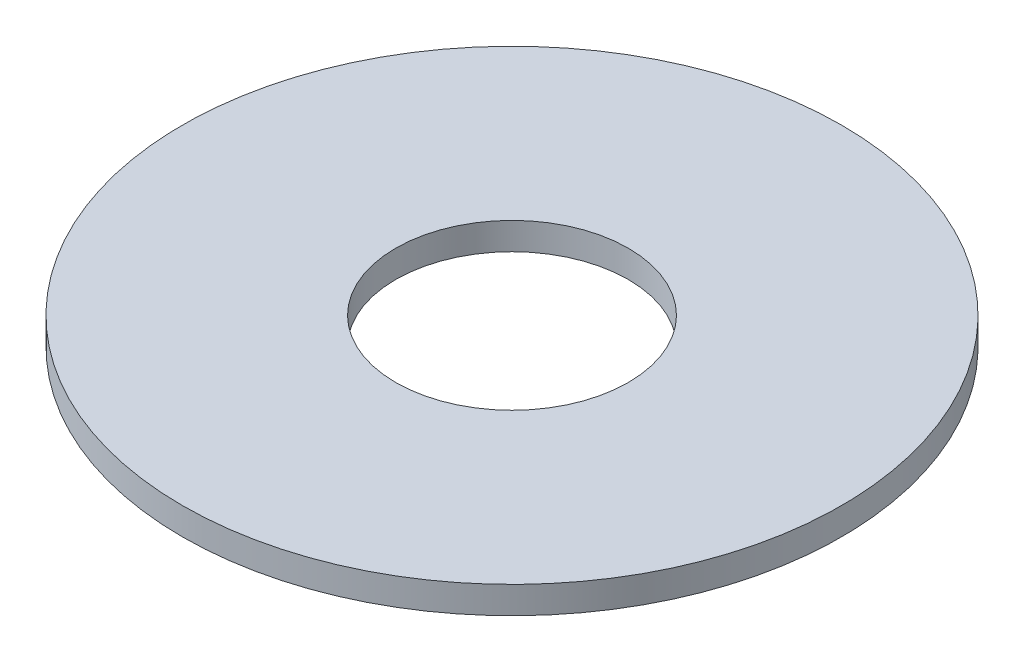
ISO-10303-21;
HEADER;
FILE_DESCRIPTION(('STEP AP214'),'2;1');
FILE_NAME('part.step','',(''),(''),'','','');
FILE_SCHEMA(('AUTOMOTIVE_DESIGN { 1 0 10303 214 1 1 1 1 }'));
ENDSEC;
DATA;
#1=APPLICATION_CONTEXT('core data for automotive mechanical design processes');
#2=APPLICATION_PROTOCOL_DEFINITION('international standard','automotive_design',2000,#1);
#3=PRODUCT_CONTEXT('',#1,'mechanical');
#4=PRODUCT('Part','Part','',(#3));
#5=PRODUCT_RELATED_PRODUCT_CATEGORY('part','',(#4));
#6=PRODUCT_DEFINITION_FORMATION('','',#4);
#7=PRODUCT_DEFINITION_CONTEXT('part definition',#1,'design');
#8=PRODUCT_DEFINITION('design','',#6,#7);
#9=PRODUCT_DEFINITION_SHAPE('','',#8);
#10=(LENGTH_UNIT() NAMED_UNIT(*) SI_UNIT(.MILLI.,.METRE.));
#11=(NAMED_UNIT(*) PLANE_ANGLE_UNIT() SI_UNIT($,.RADIAN.));
#12=(NAMED_UNIT(*) SI_UNIT($,.STERADIAN.) SOLID_ANGLE_UNIT());
#13=UNCERTAINTY_MEASURE_WITH_UNIT(LENGTH_MEASURE(1.E-05),#10,'distance_accuracy_value','');
#14=(GEOMETRIC_REPRESENTATION_CONTEXT(3) GLOBAL_UNCERTAINTY_ASSIGNED_CONTEXT((#13)) GLOBAL_UNIT_ASSIGNED_CONTEXT((#10,
#11,#12)) REPRESENTATION_CONTEXT('',''));
#15=CARTESIAN_POINT('',(0.,0.,0.));
#16=DIRECTION('',(0.,0.,1.));
#17=DIRECTION('',(1.,0.,0.));
#18=AXIS2_PLACEMENT_3D('',#15,#16,#17);
#19=CARTESIAN_POINT('',(0.,7.,0.));
#20=DIRECTION('',(0.,-1.,0.));
#21=DIRECTION('',(0.,0.,-1.));
#22=AXIS2_PLACEMENT_3D('',#19,#20,#21);
#23=CYLINDRICAL_SURFACE('',#22,85.);
#24=CARTESIAN_POINT('',(0.,7.,0.));
#25=DIRECTION('',(0.,1.,0.));
#26=DIRECTION('',(0.,0.,1.));
#27=AXIS2_PLACEMENT_3D('',#24,#25,#26);
#28=CIRCLE('',#27,85.);
#29=CARTESIAN_POINT('',(0.,7.,85.));
#30=VERTEX_POINT('',#29);
#31=EDGE_CURVE('E10',#30,#30,#28,.T.);
#32=ORIENTED_EDGE('',*,*,#31,.F.);
#33=EDGE_LOOP('',(#32));
#34=FACE_BOUND('',#33,.T.);
#35=CARTESIAN_POINT('',(0.,0.,0.));
#36=DIRECTION('',(0.,1.,0.));
#37=DIRECTION('',(0.,0.,1.));
#38=AXIS2_PLACEMENT_3D('',#35,#36,#37);
#39=CIRCLE('',#38,85.);
#40=CARTESIAN_POINT('',(0.,0.,85.));
#41=VERTEX_POINT('',#40);
#42=EDGE_CURVE('E37',#41,#41,#39,.T.);
#43=ORIENTED_EDGE('',*,*,#42,.T.);
#44=EDGE_LOOP('',(#43));
#45=FACE_BOUND('',#44,.T.);
#46=ADVANCED_FACE('F40',(#34,#45),#23,.T.);
#47=CARTESIAN_POINT('',(0.,7.,0.));
#48=DIRECTION('',(0.,1.,0.));
#49=DIRECTION('',(0.,0.,1.));
#50=AXIS2_PLACEMENT_3D('',#47,#48,#49);
#51=PLANE('',#50);
#52=CARTESIAN_POINT('',(0.,7.,0.));
#53=DIRECTION('',(0.,1.,0.));
#54=DIRECTION('',(0.,0.,1.));
#55=AXIS2_PLACEMENT_3D('',#52,#53,#54);
#56=CIRCLE('',#55,30.);
#57=CARTESIAN_POINT('',(0.,7.,30.));
#58=VERTEX_POINT('',#57);
#59=EDGE_CURVE('E50',#58,#58,#56,.T.);
#60=ORIENTED_EDGE('',*,*,#59,.F.);
#61=EDGE_LOOP('',(#60));
#62=FACE_BOUND('',#61,.T.);
#63=ORIENTED_EDGE('',*,*,#31,.T.);
#64=EDGE_LOOP('',(#63));
#65=FACE_BOUND('',#64,.T.);
#66=ADVANCED_FACE('F59',(#62,#65),#51,.T.);
#67=CARTESIAN_POINT('',(0.,0.,0.));
#68=DIRECTION('',(0.,1.,0.));
#69=DIRECTION('',(0.,0.,1.));
#70=AXIS2_PLACEMENT_3D('',#67,#68,#69);
#71=PLANE('',#70);
#72=CARTESIAN_POINT('',(0.,0.,0.));
#73=DIRECTION('',(0.,1.,0.));
#74=DIRECTION('',(0.,0.,1.));
#75=AXIS2_PLACEMENT_3D('',#72,#73,#74);
#76=CIRCLE('',#75,30.);
#77=CARTESIAN_POINT('',(0.,0.,30.));
#78=VERTEX_POINT('',#77);
#79=EDGE_CURVE('E47',#78,#78,#76,.T.);
#80=ORIENTED_EDGE('',*,*,#79,.T.);
#81=EDGE_LOOP('',(#80));
#82=FACE_BOUND('',#81,.T.);
#83=ORIENTED_EDGE('',*,*,#42,.F.);
#84=EDGE_LOOP('',(#83));
#85=FACE_BOUND('',#84,.T.);
#86=ADVANCED_FACE('F58',(#82,#85),#71,.F.);
#87=CARTESIAN_POINT('',(0.,7.,0.));
#88=DIRECTION('',(0.,-1.,0.));
#89=DIRECTION('',(0.,0.,-1.));
#90=AXIS2_PLACEMENT_3D('',#87,#88,#89);
#91=CYLINDRICAL_SURFACE('',#90,30.);
#92=ORIENTED_EDGE('',*,*,#59,.T.);
#93=EDGE_LOOP('',(#92));
#94=FACE_BOUND('',#93,.T.);
#95=ORIENTED_EDGE('',*,*,#79,.F.);
#96=EDGE_LOOP('',(#95));
#97=FACE_BOUND('',#96,.T.);
#98=ADVANCED_FACE('F54',(#94,#97),#91,.F.);
#99=CLOSED_SHELL('',(#46,#66,#86,#98));
#100=MANIFOLD_SOLID_BREP('B2',#99);
#101=ADVANCED_BREP_SHAPE_REPRESENTATION('',(#18,#100),#14);
#102=SHAPE_DEFINITION_REPRESENTATION(#9,#101);
ENDSEC;
END-ISO-10303-21;
